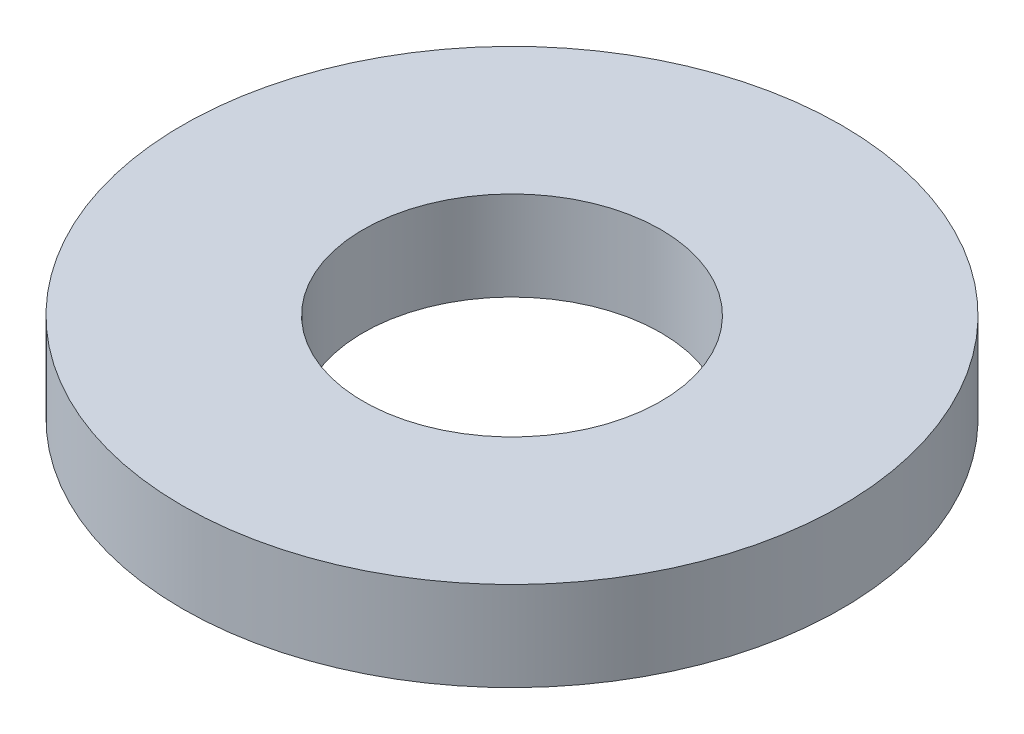
ISO-10303-21;
HEADER;
FILE_DESCRIPTION(('STEP AP214'),'2;1');
FILE_NAME('part.step','',(''),(''),'','','');
FILE_SCHEMA(('AUTOMOTIVE_DESIGN { 1 0 10303 214 1 1 1 1 }'));
ENDSEC;
DATA;
#1=APPLICATION_CONTEXT('core data for automotive mechanical design processes');
#2=APPLICATION_PROTOCOL_DEFINITION('international standard','automotive_design',2000,#1);
#3=PRODUCT_CONTEXT('',#1,'mechanical');
#4=PRODUCT('Part','Part','',(#3));
#5=PRODUCT_RELATED_PRODUCT_CATEGORY('part','',(#4));
#6=PRODUCT_DEFINITION_FORMATION('','',#4);
#7=PRODUCT_DEFINITION_CONTEXT('part definition',#1,'design');
#8=PRODUCT_DEFINITION('design','',#6,#7);
#9=PRODUCT_DEFINITION_SHAPE('','',#8);
#10=(LENGTH_UNIT() NAMED_UNIT(*) SI_UNIT(.MILLI.,.METRE.));
#11=(NAMED_UNIT(*) PLANE_ANGLE_UNIT() SI_UNIT($,.RADIAN.));
#12=(NAMED_UNIT(*) SI_UNIT($,.STERADIAN.) SOLID_ANGLE_UNIT());
#13=UNCERTAINTY_MEASURE_WITH_UNIT(LENGTH_MEASURE(1.E-05),#10,'distance_accuracy_value','');
#14=(GEOMETRIC_REPRESENTATION_CONTEXT(3) GLOBAL_UNCERTAINTY_ASSIGNED_CONTEXT((#13)) GLOBAL_UNIT_ASSIGNED_CONTEXT((#10,
#11,#12)) REPRESENTATION_CONTEXT('',''));
#15=CARTESIAN_POINT('',(0.,0.,0.));
#16=DIRECTION('',(0.,0.,1.));
#17=DIRECTION('',(1.,0.,0.));
#18=AXIS2_PLACEMENT_3D('',#15,#16,#17);
#19=CARTESIAN_POINT('',(0.,21.,0.));
#20=DIRECTION('',(0.,-1.,0.));
#21=DIRECTION('',(0.,0.,-1.));
#22=AXIS2_PLACEMENT_3D('',#19,#20,#21);
#23=CYLINDRICAL_SURFACE('',#22,77.5);
#24=CARTESIAN_POINT('',(0.,21.,0.));
#25=DIRECTION('',(0.,1.,0.));
#26=DIRECTION('',(0.,0.,1.));
#27=AXIS2_PLACEMENT_3D('',#24,#25,#26);
#28=CIRCLE('',#27,77.5);
#29=CARTESIAN_POINT('',(0.,21.,-77.5));
#30=VERTEX_POINT('',#29);
#31=EDGE_CURVE('E10',#30,#30,#28,.T.);
#32=CARTESIAN_POINT('',(0.,0.,0.));
#33=DIRECTION('',(0.,1.,0.));
#34=DIRECTION('',(0.,0.,1.));
#35=AXIS2_PLACEMENT_3D('',#32,#33,#34);
#36=CIRCLE('',#35,77.5);
#37=CARTESIAN_POINT('',(0.,0.,-77.5));
#38=VERTEX_POINT('',#37);
#39=EDGE_CURVE('E37',#38,#38,#36,.T.);
#40=CARTESIAN_POINT('',(0.,21.,-77.5));
#41=CARTESIAN_POINT('',(0.,20.78125,-77.5));
#42=CARTESIAN_POINT('',(0.,20.5625,-77.5));
#43=CARTESIAN_POINT('',(0.,20.125,-77.5));
#44=CARTESIAN_POINT('',(0.,19.90625,-77.5));
#45=CARTESIAN_POINT('',(0.,19.46875,-77.5));
#46=CARTESIAN_POINT('',(0.,19.25,-77.5));
#47=CARTESIAN_POINT('',(0.,18.8125,-77.5));
#48=CARTESIAN_POINT('',(0.,18.59375,-77.5));
#49=CARTESIAN_POINT('',(0.,18.15625,-77.5));
#50=CARTESIAN_POINT('',(0.,17.9375,-77.5));
#51=CARTESIAN_POINT('',(0.,17.5,-77.5));
#52=CARTESIAN_POINT('',(0.,17.28125,-77.5));
#53=CARTESIAN_POINT('',(0.,16.84375,-77.5));
#54=CARTESIAN_POINT('',(0.,16.625,-77.5));
#55=CARTESIAN_POINT('',(0.,16.1875,-77.5));
#56=CARTESIAN_POINT('',(0.,15.96875,-77.5));
#57=CARTESIAN_POINT('',(0.,15.53125,-77.5));
#58=CARTESIAN_POINT('',(0.,15.3125,-77.5));
#59=CARTESIAN_POINT('',(0.,14.875,-77.5));
#60=CARTESIAN_POINT('',(0.,14.65625,-77.5));
#61=CARTESIAN_POINT('',(0.,14.21875,-77.5));
#62=CARTESIAN_POINT('',(0.,14.,-77.5));
#63=CARTESIAN_POINT('',(0.,13.5625,-77.5));
#64=CARTESIAN_POINT('',(0.,13.34375,-77.5));
#65=CARTESIAN_POINT('',(0.,12.90625,-77.5));
#66=CARTESIAN_POINT('',(0.,12.6875,-77.5));
#67=CARTESIAN_POINT('',(0.,12.25,-77.5));
#68=CARTESIAN_POINT('',(0.,12.03125,-77.5));
#69=CARTESIAN_POINT('',(0.,11.59375,-77.5));
#70=CARTESIAN_POINT('',(0.,11.375,-77.5));
#71=CARTESIAN_POINT('',(0.,10.9375,-77.5));
#72=CARTESIAN_POINT('',(0.,10.71875,-77.5));
#73=CARTESIAN_POINT('',(0.,10.28125,-77.5));
#74=CARTESIAN_POINT('',(0.,10.0625,-77.5));
#75=CARTESIAN_POINT('',(0.,9.625,-77.5));
#76=CARTESIAN_POINT('',(0.,9.40625,-77.5));
#77=CARTESIAN_POINT('',(0.,8.96875,-77.5));
#78=CARTESIAN_POINT('',(0.,8.75,-77.5));
#79=CARTESIAN_POINT('',(0.,8.3125,-77.5));
#80=CARTESIAN_POINT('',(0.,8.09375,-77.5));
#81=CARTESIAN_POINT('',(0.,7.65625,-77.5));
#82=CARTESIAN_POINT('',(0.,7.4375,-77.5));
#83=CARTESIAN_POINT('',(0.,7.,-77.5));
#84=CARTESIAN_POINT('',(0.,6.78125,-77.5));
#85=CARTESIAN_POINT('',(0.,6.34375,-77.5));
#86=CARTESIAN_POINT('',(0.,6.125,-77.5));
#87=CARTESIAN_POINT('',(0.,5.6875,-77.5));
#88=CARTESIAN_POINT('',(0.,5.46875,-77.5));
#89=CARTESIAN_POINT('',(0.,5.03125,-77.5));
#90=CARTESIAN_POINT('',(0.,4.8125,-77.5));
#91=CARTESIAN_POINT('',(0.,4.375,-77.5));
#92=CARTESIAN_POINT('',(0.,4.15625,-77.5));
#93=CARTESIAN_POINT('',(0.,3.71875,-77.5));
#94=CARTESIAN_POINT('',(0.,3.5,-77.5));
#95=CARTESIAN_POINT('',(0.,3.0625,-77.5));
#96=CARTESIAN_POINT('',(0.,2.84375,-77.5));
#97=CARTESIAN_POINT('',(0.,2.40625,-77.5));
#98=CARTESIAN_POINT('',(0.,2.1875,-77.5));
#99=CARTESIAN_POINT('',(0.,1.75,-77.5));
#100=CARTESIAN_POINT('',(0.,1.53125,-77.5));
#101=CARTESIAN_POINT('',(0.,1.09375,-77.5));
#102=CARTESIAN_POINT('',(0.,0.875000000000001,-77.5));
#103=CARTESIAN_POINT('',(0.,0.4375,-77.5));
#104=CARTESIAN_POINT('',(0.,0.21875,-77.5));
#105=CARTESIAN_POINT('',(0.,0.,-77.5));
#106=B_SPLINE_CURVE_WITH_KNOTS('',3,(#40,#41,#42,#43,#44,#45,#46,#47,#48,#49,#50,#51,#52,#53,
#54,#55,#56,#57,#58,#59,#60,#61,#62,#63,#64,#65,#66,#67,#68,#69,#70,#71,#72,#73,#74,#75,#76,#77,
#78,#79,#80,#81,#82,#83,#84,#85,#86,#87,#88,#89,#90,#91,#92,#93,#94,#95,#96,#97,#98,#99,#100,
#101,#102,#103,#104,#105),.UNSPECIFIED.,.F.,.F.,(4,2,2,2,2,2,2,2,2,2,2,2,2,2,2,2,2,2,2,2,2,2,2,
2,2,2,2,2,2,2,2,2,4),(0.,0.656249999999997,1.3125,1.96875,2.625,3.28125,3.9375,4.59375,5.25,
5.90625,6.5625,7.21875,7.875,8.53125,9.1875,9.84375,10.5,11.15625,11.8125,12.46875,13.125,
13.78125,14.4375,15.09375,15.75,16.40625,17.0625,17.71875,18.375,19.03125,19.6875,20.34375,21.),.UNSPECIFIED.);
#107=EDGE_CURVE('BSEAM40',#30,#38,#106,.T.);
#108=ORIENTED_EDGE('',*,*,#31,.F.);
#109=ORIENTED_EDGE('',*,*,#39,.T.);
#110=ORIENTED_EDGE('',*,*,#107,.T.);
#111=ORIENTED_EDGE('',*,*,#107,.F.);
#112=EDGE_LOOP('',(#108,#110,#109,#111));
#113=FACE_BOUND('',#112,.T.);
#114=ADVANCED_FACE('F40',(#113),#23,.T.);
#115=CARTESIAN_POINT('',(0.,21.,0.));
#116=DIRECTION('',(0.,1.,0.));
#117=DIRECTION('',(0.,0.,1.));
#118=AXIS2_PLACEMENT_3D('',#115,#116,#117);
#119=PLANE('',#118);
#120=CARTESIAN_POINT('',(0.,21.,0.));
#121=DIRECTION('',(0.,1.,0.));
#122=DIRECTION('',(0.,0.,1.));
#123=AXIS2_PLACEMENT_3D('',#120,#121,#122);
#124=CIRCLE('',#123,35.);
#125=CARTESIAN_POINT('',(0.,21.,-35.));
#126=VERTEX_POINT('',#125);
#127=EDGE_CURVE('E50',#126,#126,#124,.T.);
#128=ORIENTED_EDGE('',*,*,#127,.F.);
#129=EDGE_LOOP('',(#128));
#130=FACE_BOUND('',#129,.T.);
#131=ORIENTED_EDGE('',*,*,#31,.T.);
#132=EDGE_LOOP('',(#131));
#133=FACE_BOUND('',#132,.T.);
#134=ADVANCED_FACE('F59',(#130,#133),#119,.T.);
#135=CARTESIAN_POINT('',(0.,0.,0.));
#136=DIRECTION('',(0.,1.,0.));
#137=DIRECTION('',(0.,0.,1.));
#138=AXIS2_PLACEMENT_3D('',#135,#136,#137);
#139=PLANE('',#138);
#140=CARTESIAN_POINT('',(0.,0.,0.));
#141=DIRECTION('',(0.,1.,0.));
#142=DIRECTION('',(0.,0.,1.));
#143=AXIS2_PLACEMENT_3D('',#140,#141,#142);
#144=CIRCLE('',#143,35.);
#145=CARTESIAN_POINT('',(0.,0.,-35.));
#146=VERTEX_POINT('',#145);
#147=EDGE_CURVE('E47',#146,#146,#144,.T.);
#148=ORIENTED_EDGE('',*,*,#147,.T.);
#149=EDGE_LOOP('',(#148));
#150=FACE_BOUND('',#149,.T.);
#151=ORIENTED_EDGE('',*,*,#39,.F.);
#152=EDGE_LOOP('',(#151));
#153=FACE_BOUND('',#152,.T.);
#154=ADVANCED_FACE('F58',(#150,#153),#139,.F.);
#155=CARTESIAN_POINT('',(0.,21.,0.));
#156=DIRECTION('',(0.,-1.,0.));
#157=DIRECTION('',(0.,0.,-1.));
#158=AXIS2_PLACEMENT_3D('',#155,#156,#157);
#159=CYLINDRICAL_SURFACE('',#158,35.);
#160=CARTESIAN_POINT('',(0.,21.,-35.));
#161=CARTESIAN_POINT('',(0.,20.78125,-35.));
#162=CARTESIAN_POINT('',(0.,20.5625,-35.));
#163=CARTESIAN_POINT('',(0.,20.125,-35.));
#164=CARTESIAN_POINT('',(0.,19.90625,-35.));
#165=CARTESIAN_POINT('',(0.,19.46875,-35.));
#166=CARTESIAN_POINT('',(0.,19.25,-35.));
#167=CARTESIAN_POINT('',(0.,18.8125,-35.));
#168=CARTESIAN_POINT('',(0.,18.59375,-35.));
#169=CARTESIAN_POINT('',(0.,18.15625,-35.));
#170=CARTESIAN_POINT('',(0.,17.9375,-35.));
#171=CARTESIAN_POINT('',(0.,17.5,-35.));
#172=CARTESIAN_POINT('',(0.,17.28125,-35.));
#173=CARTESIAN_POINT('',(0.,16.84375,-35.));
#174=CARTESIAN_POINT('',(0.,16.625,-35.));
#175=CARTESIAN_POINT('',(0.,16.1875,-35.));
#176=CARTESIAN_POINT('',(0.,15.96875,-35.));
#177=CARTESIAN_POINT('',(0.,15.53125,-35.));
#178=CARTESIAN_POINT('',(0.,15.3125,-35.));
#179=CARTESIAN_POINT('',(0.,14.875,-35.));
#180=CARTESIAN_POINT('',(0.,14.65625,-35.));
#181=CARTESIAN_POINT('',(0.,14.21875,-35.));
#182=CARTESIAN_POINT('',(0.,14.,-35.));
#183=CARTESIAN_POINT('',(0.,13.5625,-35.));
#184=CARTESIAN_POINT('',(0.,13.34375,-35.));
#185=CARTESIAN_POINT('',(0.,12.90625,-35.));
#186=CARTESIAN_POINT('',(0.,12.6875,-35.));
#187=CARTESIAN_POINT('',(0.,12.25,-35.));
#188=CARTESIAN_POINT('',(0.,12.03125,-35.));
#189=CARTESIAN_POINT('',(0.,11.59375,-35.));
#190=CARTESIAN_POINT('',(0.,11.375,-35.));
#191=CARTESIAN_POINT('',(0.,10.9375,-35.));
#192=CARTESIAN_POINT('',(0.,10.71875,-35.));
#193=CARTESIAN_POINT('',(0.,10.28125,-35.));
#194=CARTESIAN_POINT('',(0.,10.0625,-35.));
#195=CARTESIAN_POINT('',(0.,9.625,-35.));
#196=CARTESIAN_POINT('',(0.,9.40625,-35.));
#197=CARTESIAN_POINT('',(0.,8.96875,-35.));
#198=CARTESIAN_POINT('',(0.,8.75,-35.));
#199=CARTESIAN_POINT('',(0.,8.3125,-35.));
#200=CARTESIAN_POINT('',(0.,8.09375,-35.));
#201=CARTESIAN_POINT('',(0.,7.65625,-35.));
#202=CARTESIAN_POINT('',(0.,7.4375,-35.));
#203=CARTESIAN_POINT('',(0.,7.,-35.));
#204=CARTESIAN_POINT('',(0.,6.78125,-35.));
#205=CARTESIAN_POINT('',(0.,6.34375,-35.));
#206=CARTESIAN_POINT('',(0.,6.125,-35.));
#207=CARTESIAN_POINT('',(0.,5.6875,-35.));
#208=CARTESIAN_POINT('',(0.,5.46875,-35.));
#209=CARTESIAN_POINT('',(0.,5.03125,-35.));
#210=CARTESIAN_POINT('',(0.,4.8125,-35.));
#211=CARTESIAN_POINT('',(0.,4.375,-35.));
#212=CARTESIAN_POINT('',(0.,4.15625,-35.));
#213=CARTESIAN_POINT('',(0.,3.71875,-35.));
#214=CARTESIAN_POINT('',(0.,3.5,-35.));
#215=CARTESIAN_POINT('',(0.,3.0625,-35.));
#216=CARTESIAN_POINT('',(0.,2.84375,-35.));
#217=CARTESIAN_POINT('',(0.,2.40625,-35.));
#218=CARTESIAN_POINT('',(0.,2.1875,-35.));
#219=CARTESIAN_POINT('',(0.,1.75,-35.));
#220=CARTESIAN_POINT('',(0.,1.53125,-35.));
#221=CARTESIAN_POINT('',(0.,1.09375,-35.));
#222=CARTESIAN_POINT('',(0.,0.875000000000001,-35.));
#223=CARTESIAN_POINT('',(0.,0.4375,-35.));
#224=CARTESIAN_POINT('',(0.,0.21875,-35.));
#225=CARTESIAN_POINT('',(0.,0.,-35.));
#226=B_SPLINE_CURVE_WITH_KNOTS('',3,(#160,#161,#162,#163,#164,#165,#166,#167,#168,#169,#170,
#171,#172,#173,#174,#175,#176,#177,#178,#179,#180,#181,#182,#183,#184,#185,#186,#187,#188,#189,
#190,#191,#192,#193,#194,#195,#196,#197,#198,#199,#200,#201,#202,#203,#204,#205,#206,#207,#208,
#209,#210,#211,#212,#213,#214,#215,#216,#217,#218,#219,#220,#221,#222,#223,#224,#225),
.UNSPECIFIED.,.F.,.F.,(4,2,2,2,2,2,2,2,2,2,2,2,2,2,2,2,2,2,2,2,2,2,2,2,2,2,2,2,2,2,2,2,4),(0.,
0.656250000000001,1.3125,1.96875,2.625,3.28125,3.9375,4.59375,5.25,5.90625,6.5625,7.21875,7.875,
8.53125,9.1875,9.84375,10.5,11.15625,11.8125,12.46875,13.125,13.78125,14.4375,15.09375,15.75,
16.40625,17.0625,17.71875,18.375,19.03125,19.6875,20.34375,21.),.UNSPECIFIED.);
#227=EDGE_CURVE('BSEAM54',#126,#146,#226,.T.);
#228=ORIENTED_EDGE('',*,*,#127,.T.);
#229=ORIENTED_EDGE('',*,*,#147,.F.);
#230=ORIENTED_EDGE('',*,*,#227,.T.);
#231=ORIENTED_EDGE('',*,*,#227,.F.);
#232=EDGE_LOOP('',(#228,#230,#229,#231));
#233=FACE_BOUND('',#232,.T.);
#234=ADVANCED_FACE('F54',(#233),#159,.F.);
#235=CLOSED_SHELL('',(#114,#134,#154,#234));
#236=MANIFOLD_SOLID_BREP('B2',#235);
#237=ADVANCED_BREP_SHAPE_REPRESENTATION('',(#18,#236),#14);
#238=SHAPE_DEFINITION_REPRESENTATION(#9,#237);
ENDSEC;
END-ISO-10303-21;
